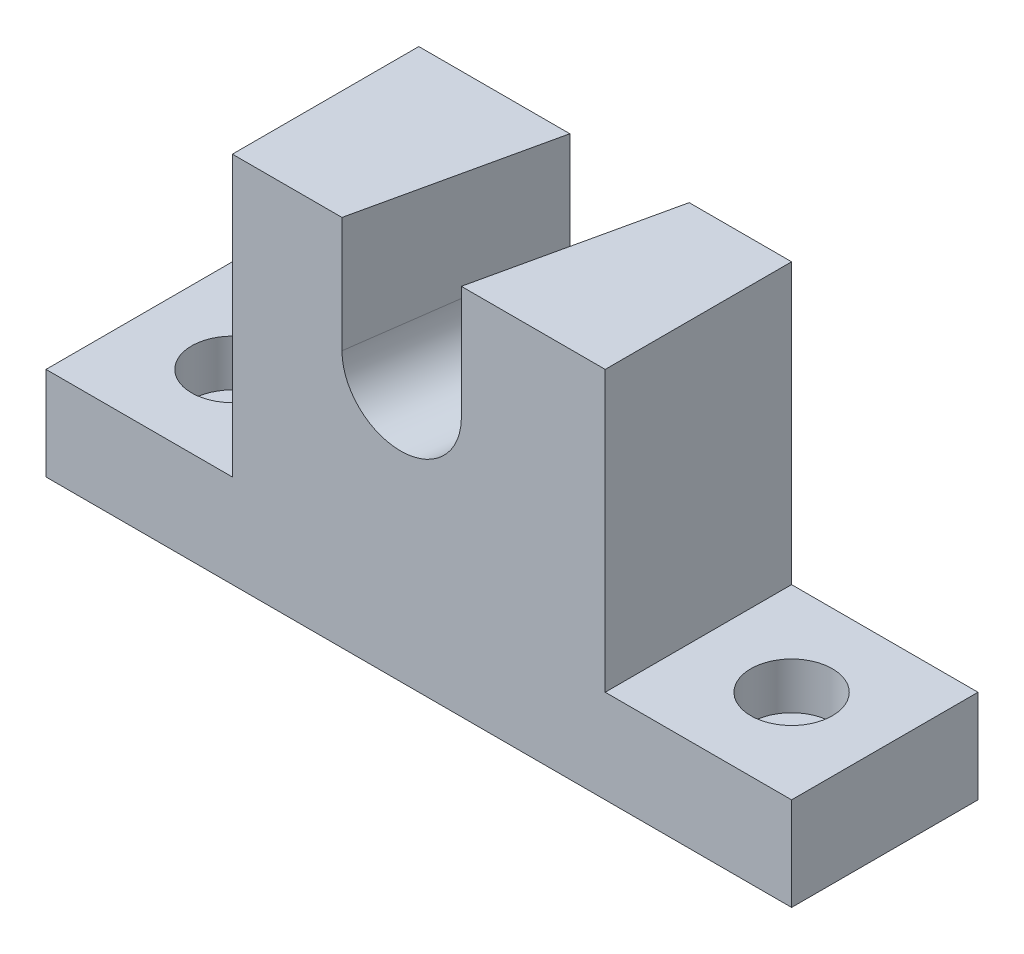
ISO-10303-21;
HEADER;
FILE_DESCRIPTION(('STEP AP214'),'2;1');
FILE_NAME('part.step','',(''),(''),'','','');
FILE_SCHEMA(('AUTOMOTIVE_DESIGN { 1 0 10303 214 1 1 1 1 }'));
ENDSEC;
DATA;
#1=APPLICATION_CONTEXT('core data for automotive mechanical design processes');
#2=APPLICATION_PROTOCOL_DEFINITION('international standard','automotive_design',2000,#1);
#3=PRODUCT_CONTEXT('',#1,'mechanical');
#4=PRODUCT('Part','Part','',(#3));
#5=PRODUCT_RELATED_PRODUCT_CATEGORY('part','',(#4));
#6=PRODUCT_DEFINITION_FORMATION('','',#4);
#7=PRODUCT_DEFINITION_CONTEXT('part definition',#1,'design');
#8=PRODUCT_DEFINITION('design','',#6,#7);
#9=PRODUCT_DEFINITION_SHAPE('','',#8);
#10=(LENGTH_UNIT() NAMED_UNIT(*) SI_UNIT(.MILLI.,.METRE.));
#11=(NAMED_UNIT(*) PLANE_ANGLE_UNIT() SI_UNIT($,.RADIAN.));
#12=(NAMED_UNIT(*) SI_UNIT($,.STERADIAN.) SOLID_ANGLE_UNIT());
#13=UNCERTAINTY_MEASURE_WITH_UNIT(LENGTH_MEASURE(1.E-05),#10,'distance_accuracy_value','');
#14=(GEOMETRIC_REPRESENTATION_CONTEXT(3) GLOBAL_UNCERTAINTY_ASSIGNED_CONTEXT((#13)) GLOBAL_UNIT_ASSIGNED_CONTEXT((#10,
#11,#12)) REPRESENTATION_CONTEXT('',''));
#15=CARTESIAN_POINT('',(0.,0.,0.));
#16=DIRECTION('',(0.,0.,1.));
#17=DIRECTION('',(1.,0.,0.));
#18=AXIS2_PLACEMENT_3D('',#15,#16,#17);
#19=CARTESIAN_POINT('',(-25.4,50.8,25.4));
#20=DIRECTION('',(0.,-1.,0.));
#21=DIRECTION('',(1.,0.,0.));
#22=AXIS2_PLACEMENT_3D('',#19,#20,#21);
#23=PLANE('',#22);
#24=DIRECTION('',(-0.217081662800933,0.,0.976153446787738));
#25=VECTOR('',#24,1.);
#26=CARTESIAN_POINT('',(-11.1715289843318,50.8,28.564195298762));
#27=LINE('',#26,#25);
#28=CARTESIAN_POINT('',(-4.81928689326416,50.8,0.));
#29=VERTEX_POINT('',#28);
#30=CARTESIAN_POINT('',(-10.4678601306874,50.8,25.4));
#31=VERTEX_POINT('',#30);
#32=EDGE_CURVE('E298',#29,#31,#27,.T.);
#33=ORIENTED_EDGE('',*,*,#32,.F.);
#34=DIRECTION('',(-1.,0.,0.));
#35=VECTOR('',#34,1.);
#36=CARTESIAN_POINT('',(-25.4,50.8,0.));
#37=LINE('',#36,#35);
#38=CARTESIAN_POINT('',(-25.4,50.8,0.));
#39=VERTEX_POINT('',#38);
#40=EDGE_CURVE('E131',#29,#39,#37,.T.);
#41=ORIENTED_EDGE('',*,*,#40,.T.);
#42=DIRECTION('',(0.,0.,-1.));
#43=VECTOR('',#42,1.);
#44=CARTESIAN_POINT('',(-25.4,50.8,25.4));
#45=LINE('',#44,#43);
#46=CARTESIAN_POINT('',(-25.4,50.8,25.4));
#47=VERTEX_POINT('',#46);
#48=EDGE_CURVE('E129',#47,#39,#45,.T.);
#49=ORIENTED_EDGE('',*,*,#48,.F.);
#50=DIRECTION('',(-1.,0.,0.));
#51=VECTOR('',#50,1.);
#52=CARTESIAN_POINT('',(-25.4,50.8,25.4));
#53=LINE('',#52,#51);
#54=EDGE_CURVE('E114',#31,#47,#53,.T.);
#55=ORIENTED_EDGE('',*,*,#54,.F.);
#56=EDGE_LOOP('',(#33,#41,#49,#55));
#57=FACE_BOUND('',#56,.T.);
#58=ADVANCED_FACE('F32',(#57),#23,.F.);
#59=CARTESIAN_POINT('',(0.,0.,25.4));
#60=DIRECTION('',(0.,0.,1.));
#61=DIRECTION('',(1.,0.,0.));
#62=AXIS2_PLACEMENT_3D('',#59,#60,#61);
#63=PLANE('',#62);
#64=CARTESIAN_POINT('',(-2.33645412467455,35.1902239310147,25.4));
#65=DIRECTION('',(0.,0.,1.));
#66=DIRECTION('',(-0.947845164465853,-0.318731147205134,0.));
#67=AXIS2_PLACEMENT_3D('',#64,#65,#66);
#68=ELLIPSE('',#67,8.15304209411346,7.9375);
#69=CARTESIAN_POINT('',(5.79495188133834,35.3190782655296,25.4));
#70=VERTEX_POINT('',#69);
#71=CARTESIAN_POINT('',(-10.4678601306874,35.0613695964998,25.4));
#72=VERTEX_POINT('',#71);
#73=EDGE_CURVE('E297',#70,#72,#68,.F.);
#74=ORIENTED_EDGE('',*,*,#73,.T.);
#75=DIRECTION('',(0.,1.,0.));
#76=VECTOR('',#75,1.);
#77=CARTESIAN_POINT('',(-10.4678601306874,0.,25.4));
#78=LINE('',#77,#76);
#79=EDGE_CURVE('E122',#72,#31,#78,.T.);
#80=ORIENTED_EDGE('',*,*,#79,.T.);
#81=ORIENTED_EDGE('',*,*,#54,.T.);
#82=DIRECTION('',(0.,-1.,0.));
#83=VECTOR('',#82,1.);
#84=CARTESIAN_POINT('',(-25.4,50.8,25.4));
#85=LINE('',#84,#83);
#86=CARTESIAN_POINT('',(-25.4,12.7,25.4));
#87=VERTEX_POINT('',#86);
#88=EDGE_CURVE('E119',#47,#87,#85,.T.);
#89=ORIENTED_EDGE('',*,*,#88,.T.);
#90=DIRECTION('',(-1.,0.,0.));
#91=VECTOR('',#90,1.);
#92=CARTESIAN_POINT('',(-50.8,12.7,25.4));
#93=LINE('',#92,#91);
#94=CARTESIAN_POINT('',(-50.8,12.7,25.4));
#95=VERTEX_POINT('',#94);
#96=EDGE_CURVE('E56',#87,#95,#93,.T.);
#97=ORIENTED_EDGE('',*,*,#96,.T.);
#98=DIRECTION('',(0.,-1.,0.));
#99=VECTOR('',#98,1.);
#100=CARTESIAN_POINT('',(-50.8,12.7,25.4));
#101=LINE('',#100,#99);
#102=CARTESIAN_POINT('',(-50.8,0.,25.4));
#103=VERTEX_POINT('',#102);
#104=EDGE_CURVE('E162',#95,#103,#101,.T.);
#105=ORIENTED_EDGE('',*,*,#104,.T.);
#106=DIRECTION('',(1.,0.,0.));
#107=VECTOR('',#106,1.);
#108=CARTESIAN_POINT('',(-50.8,0.,25.4));
#109=LINE('',#108,#107);
#110=CARTESIAN_POINT('',(50.8,0.,25.4));
#111=VERTEX_POINT('',#110);
#112=EDGE_CURVE('E98',#103,#111,#109,.T.);
#113=ORIENTED_EDGE('',*,*,#112,.T.);
#114=DIRECTION('',(0.,1.,0.));
#115=VECTOR('',#114,1.);
#116=CARTESIAN_POINT('',(50.8,12.7,25.4));
#117=LINE('',#116,#115);
#118=CARTESIAN_POINT('',(50.8,12.7,25.4));
#119=VERTEX_POINT('',#118);
#120=EDGE_CURVE('E230',#111,#119,#117,.T.);
#121=ORIENTED_EDGE('',*,*,#120,.T.);
#122=DIRECTION('',(-1.,0.,0.));
#123=VECTOR('',#122,1.);
#124=CARTESIAN_POINT('',(25.4,12.7,25.4));
#125=LINE('',#124,#123);
#126=CARTESIAN_POINT('',(25.4,12.7,25.4));
#127=VERTEX_POINT('',#126);
#128=EDGE_CURVE('E226',#119,#127,#125,.T.);
#129=ORIENTED_EDGE('',*,*,#128,.T.);
#130=DIRECTION('',(0.,1.,0.));
#131=VECTOR('',#130,1.);
#132=CARTESIAN_POINT('',(25.4,50.8,25.4));
#133=LINE('',#132,#131);
#134=CARTESIAN_POINT('',(25.4,50.8,25.4));
#135=VERTEX_POINT('',#134);
#136=EDGE_CURVE('E126',#127,#135,#133,.T.);
#137=ORIENTED_EDGE('',*,*,#136,.T.);
#138=CARTESIAN_POINT('',(5.79495188133833,50.8,25.4));
#139=VERTEX_POINT('',#138);
#140=EDGE_CURVE('E125',#135,#139,#53,.T.);
#141=ORIENTED_EDGE('',*,*,#140,.T.);
#142=DIRECTION('',(0.,1.,0.));
#143=VECTOR('',#142,1.);
#144=CARTESIAN_POINT('',(5.79495188133835,0.,25.4));
#145=LINE('',#144,#143);
#146=EDGE_CURVE('E296',#70,#139,#145,.T.);
#147=ORIENTED_EDGE('',*,*,#146,.F.);
#148=EDGE_LOOP('',(#74,#80,#81,#89,#97,#105,#113,#121,#129,#137,#141,#147));
#149=FACE_BOUND('',#148,.T.);
#150=ADVANCED_FACE('F117',(#149),#63,.T.);
#151=CARTESIAN_POINT('',(0.,0.,0.));
#152=DIRECTION('',(0.,0.,1.));
#153=DIRECTION('',(1.,0.,0.));
#154=AXIS2_PLACEMENT_3D('',#151,#152,#153);
#155=PLANE('',#154);
#156=DIRECTION('',(0.,1.,0.));
#157=VECTOR('',#156,1.);
#158=CARTESIAN_POINT('',(-4.81928689326416,0.,0.));
#159=LINE('',#158,#157);
#160=CARTESIAN_POINT('',(-4.81928689326416,36.9608108718591,0.));
#161=VERTEX_POINT('',#160);
#162=EDGE_CURVE('E11',#161,#29,#159,.T.);
#163=ORIENTED_EDGE('',*,*,#162,.F.);
#164=CARTESIAN_POINT('',(3.31211911274873,37.089665206374,0.));
#165=DIRECTION('',(0.,0.,1.));
#166=DIRECTION('',(-0.947845164465853,-0.318731147205134,0.));
#167=AXIS2_PLACEMENT_3D('',#164,#165,#166);
#168=ELLIPSE('',#167,8.15304209411346,7.9375);
#169=CARTESIAN_POINT('',(11.4435251187616,37.2185195408889,0.));
#170=VERTEX_POINT('',#169);
#171=EDGE_CURVE('E40',#170,#161,#168,.F.);
#172=ORIENTED_EDGE('',*,*,#171,.F.);
#173=DIRECTION('',(0.,1.,0.));
#174=VECTOR('',#173,1.);
#175=CARTESIAN_POINT('',(11.4435251187616,0.,0.));
#176=LINE('',#175,#174);
#177=CARTESIAN_POINT('',(11.4435251187616,50.8,0.));
#178=VERTEX_POINT('',#177);
#179=EDGE_CURVE('E178',#170,#178,#176,.T.);
#180=ORIENTED_EDGE('',*,*,#179,.T.);
#181=CARTESIAN_POINT('',(25.4,50.8,0.));
#182=VERTEX_POINT('',#181);
#183=EDGE_CURVE('E156',#182,#178,#37,.T.);
#184=ORIENTED_EDGE('',*,*,#183,.F.);
#185=DIRECTION('',(0.,1.,0.));
#186=VECTOR('',#185,1.);
#187=CARTESIAN_POINT('',(25.4,50.8,0.));
#188=LINE('',#187,#186);
#189=CARTESIAN_POINT('',(25.4,12.7,0.));
#190=VERTEX_POINT('',#189);
#191=EDGE_CURVE('E154',#190,#182,#188,.T.);
#192=ORIENTED_EDGE('',*,*,#191,.F.);
#193=DIRECTION('',(-1.,0.,0.));
#194=VECTOR('',#193,1.);
#195=CARTESIAN_POINT('',(25.4,12.7,0.));
#196=LINE('',#195,#194);
#197=CARTESIAN_POINT('',(50.8,12.7,0.));
#198=VERTEX_POINT('',#197);
#199=EDGE_CURVE('E152',#198,#190,#196,.T.);
#200=ORIENTED_EDGE('',*,*,#199,.F.);
#201=DIRECTION('',(0.,1.,0.));
#202=VECTOR('',#201,1.);
#203=CARTESIAN_POINT('',(50.8,12.7,0.));
#204=LINE('',#203,#202);
#205=CARTESIAN_POINT('',(50.8,0.,0.));
#206=VERTEX_POINT('',#205);
#207=EDGE_CURVE('E150',#206,#198,#204,.T.);
#208=ORIENTED_EDGE('',*,*,#207,.F.);
#209=DIRECTION('',(1.,0.,0.));
#210=VECTOR('',#209,1.);
#211=CARTESIAN_POINT('',(-50.8,0.,0.));
#212=LINE('',#211,#210);
#213=CARTESIAN_POINT('',(-50.8,0.,0.));
#214=VERTEX_POINT('',#213);
#215=EDGE_CURVE('E147',#214,#206,#212,.T.);
#216=ORIENTED_EDGE('',*,*,#215,.F.);
#217=DIRECTION('',(0.,-1.,0.));
#218=VECTOR('',#217,1.);
#219=CARTESIAN_POINT('',(-50.8,12.7,0.));
#220=LINE('',#219,#218);
#221=CARTESIAN_POINT('',(-50.8,12.7,0.));
#222=VERTEX_POINT('',#221);
#223=EDGE_CURVE('E144',#222,#214,#220,.T.);
#224=ORIENTED_EDGE('',*,*,#223,.F.);
#225=DIRECTION('',(-1.,0.,0.));
#226=VECTOR('',#225,1.);
#227=CARTESIAN_POINT('',(-50.8,12.7,0.));
#228=LINE('',#227,#226);
#229=CARTESIAN_POINT('',(-25.4,12.7,0.));
#230=VERTEX_POINT('',#229);
#231=EDGE_CURVE('E89',#230,#222,#228,.T.);
#232=ORIENTED_EDGE('',*,*,#231,.F.);
#233=DIRECTION('',(0.,-1.,0.));
#234=VECTOR('',#233,1.);
#235=CARTESIAN_POINT('',(-25.4,50.8,0.));
#236=LINE('',#235,#234);
#237=EDGE_CURVE('E159',#39,#230,#236,.T.);
#238=ORIENTED_EDGE('',*,*,#237,.F.);
#239=ORIENTED_EDGE('',*,*,#40,.F.);
#240=EDGE_LOOP('',(#163,#172,#180,#184,#192,#200,#208,#216,#224,#232,#238,#239));
#241=FACE_BOUND('',#240,.T.);
#242=ADVANCED_FACE('F202',(#241),#155,.F.);
#243=CARTESIAN_POINT('',(-50.8,12.7,25.4));
#244=DIRECTION('',(1.,0.,0.));
#245=DIRECTION('',(0.,1.,0.));
#246=AXIS2_PLACEMENT_3D('',#243,#244,#245);
#247=PLANE('',#246);
#248=ORIENTED_EDGE('',*,*,#223,.T.);
#249=DIRECTION('',(0.,0.,-1.));
#250=VECTOR('',#249,1.);
#251=CARTESIAN_POINT('',(-50.8,0.,25.4));
#252=LINE('',#251,#250);
#253=EDGE_CURVE('E176',#103,#214,#252,.T.);
#254=ORIENTED_EDGE('',*,*,#253,.F.);
#255=ORIENTED_EDGE('',*,*,#104,.F.);
#256=DIRECTION('',(0.,0.,-1.));
#257=VECTOR('',#256,1.);
#258=CARTESIAN_POINT('',(-50.8,12.7,25.4));
#259=LINE('',#258,#257);
#260=EDGE_CURVE('E139',#95,#222,#259,.T.);
#261=ORIENTED_EDGE('',*,*,#260,.T.);
#262=EDGE_LOOP('',(#248,#254,#255,#261));
#263=FACE_BOUND('',#262,.T.);
#264=ADVANCED_FACE('F34',(#263),#247,.F.);
#265=CARTESIAN_POINT('',(-50.8,0.,25.4));
#266=DIRECTION('',(0.,1.,0.));
#267=DIRECTION('',(-1.,0.,0.));
#268=AXIS2_PLACEMENT_3D('',#265,#266,#267);
#269=PLANE('',#268);
#270=CARTESIAN_POINT('',(-38.1,0.,12.7));
#271=DIRECTION('',(0.,1.,0.));
#272=DIRECTION('',(0.,0.,1.));
#273=AXIS2_PLACEMENT_3D('',#270,#271,#272);
#274=CIRCLE('',#273,3.3782);
#275=CARTESIAN_POINT('',(-38.1,0.,16.0782));
#276=VERTEX_POINT('',#275);
#277=EDGE_CURVE('E283',#276,#276,#274,.T.);
#278=ORIENTED_EDGE('',*,*,#277,.T.);
#279=EDGE_LOOP('',(#278));
#280=FACE_BOUND('',#279,.T.);
#281=CARTESIAN_POINT('',(38.1,0.,12.7));
#282=DIRECTION('',(0.,1.,0.));
#283=DIRECTION('',(0.,0.,1.));
#284=AXIS2_PLACEMENT_3D('',#281,#282,#283);
#285=CIRCLE('',#284,3.3782);
#286=CARTESIAN_POINT('',(38.1,0.,16.0782));
#287=VERTEX_POINT('',#286);
#288=EDGE_CURVE('E148',#287,#287,#285,.T.);
#289=ORIENTED_EDGE('',*,*,#288,.T.);
#290=EDGE_LOOP('',(#289));
#291=FACE_BOUND('',#290,.T.);
#292=ORIENTED_EDGE('',*,*,#215,.T.);
#293=DIRECTION('',(0.,0.,-1.));
#294=VECTOR('',#293,1.);
#295=CARTESIAN_POINT('',(50.8,0.,25.4));
#296=LINE('',#295,#294);
#297=EDGE_CURVE('E173',#111,#206,#296,.T.);
#298=ORIENTED_EDGE('',*,*,#297,.F.);
#299=ORIENTED_EDGE('',*,*,#112,.F.);
#300=ORIENTED_EDGE('',*,*,#253,.T.);
#301=EDGE_LOOP('',(#292,#298,#299,#300));
#302=FACE_BOUND('',#301,.T.);
#303=ADVANCED_FACE('F231',(#280,#291,#302),#269,.F.);
#304=CARTESIAN_POINT('',(50.8,12.7,25.4));
#305=DIRECTION('',(-1.,0.,0.));
#306=DIRECTION('',(0.,-1.,0.));
#307=AXIS2_PLACEMENT_3D('',#304,#305,#306);
#308=PLANE('',#307);
#309=ORIENTED_EDGE('',*,*,#207,.T.);
#310=DIRECTION('',(0.,0.,-1.));
#311=VECTOR('',#310,1.);
#312=CARTESIAN_POINT('',(50.8,12.7,25.4));
#313=LINE('',#312,#311);
#314=EDGE_CURVE('E170',#119,#198,#313,.T.);
#315=ORIENTED_EDGE('',*,*,#314,.F.);
#316=ORIENTED_EDGE('',*,*,#120,.F.);
#317=ORIENTED_EDGE('',*,*,#297,.T.);
#318=EDGE_LOOP('',(#309,#315,#316,#317));
#319=FACE_BOUND('',#318,.T.);
#320=ADVANCED_FACE('F229',(#319),#308,.F.);
#321=CARTESIAN_POINT('',(25.4,12.7,25.4));
#322=DIRECTION('',(0.,-1.,0.));
#323=DIRECTION('',(0.,0.,-1.));
#324=AXIS2_PLACEMENT_3D('',#321,#322,#323);
#325=PLANE('',#324);
#326=CARTESIAN_POINT('',(38.1,12.7,12.7));
#327=DIRECTION('',(0.,1.,0.));
#328=DIRECTION('',(0.,0.,1.));
#329=AXIS2_PLACEMENT_3D('',#326,#327,#328);
#330=CIRCLE('',#329,5.55625);
#331=CARTESIAN_POINT('',(38.1,12.7,18.25625));
#332=VERTEX_POINT('',#331);
#333=EDGE_CURVE('E315',#332,#332,#330,.T.);
#334=ORIENTED_EDGE('',*,*,#333,.F.);
#335=EDGE_LOOP('',(#334));
#336=FACE_BOUND('',#335,.T.);
#337=ORIENTED_EDGE('',*,*,#199,.T.);
#338=DIRECTION('',(0.,0.,-1.));
#339=VECTOR('',#338,1.);
#340=CARTESIAN_POINT('',(25.4,12.7,25.4));
#341=LINE('',#340,#339);
#342=EDGE_CURVE('E167',#127,#190,#341,.T.);
#343=ORIENTED_EDGE('',*,*,#342,.F.);
#344=ORIENTED_EDGE('',*,*,#128,.F.);
#345=ORIENTED_EDGE('',*,*,#314,.T.);
#346=EDGE_LOOP('',(#337,#343,#344,#345));
#347=FACE_BOUND('',#346,.T.);
#348=ADVANCED_FACE('F223',(#336,#347),#325,.F.);
#349=CARTESIAN_POINT('',(25.4,50.8,25.4));
#350=DIRECTION('',(-1.,0.,0.));
#351=DIRECTION('',(0.,-1.,0.));
#352=AXIS2_PLACEMENT_3D('',#349,#350,#351);
#353=PLANE('',#352);
#354=ORIENTED_EDGE('',*,*,#191,.T.);
#355=DIRECTION('',(0.,0.,-1.));
#356=VECTOR('',#355,1.);
#357=CARTESIAN_POINT('',(25.4,50.8,25.4));
#358=LINE('',#357,#356);
#359=EDGE_CURVE('E134',#135,#182,#358,.T.);
#360=ORIENTED_EDGE('',*,*,#359,.F.);
#361=ORIENTED_EDGE('',*,*,#136,.F.);
#362=ORIENTED_EDGE('',*,*,#342,.T.);
#363=EDGE_LOOP('',(#354,#360,#361,#362));
#364=FACE_BOUND('',#363,.T.);
#365=ADVANCED_FACE('F218',(#364),#353,.F.);
#366=ORIENTED_EDGE('',*,*,#183,.T.);
#367=DIRECTION('',(-0.217081662800933,0.,0.976153446787738));
#368=VECTOR('',#367,1.);
#369=CARTESIAN_POINT('',(4.32490698342349,50.8,32.0103666957269));
#370=LINE('',#369,#368);
#371=EDGE_CURVE('E47',#178,#139,#370,.T.);
#372=ORIENTED_EDGE('',*,*,#371,.T.);
#373=ORIENTED_EDGE('',*,*,#140,.F.);
#374=ORIENTED_EDGE('',*,*,#359,.T.);
#375=EDGE_LOOP('',(#366,#372,#373,#374));
#376=FACE_BOUND('',#375,.T.);
#377=ADVANCED_FACE('F213',(#376),#23,.F.);
#378=CARTESIAN_POINT('',(-25.4,50.8,25.4));
#379=DIRECTION('',(1.,0.,0.));
#380=DIRECTION('',(0.,1.,0.));
#381=AXIS2_PLACEMENT_3D('',#378,#379,#380);
#382=PLANE('',#381);
#383=ORIENTED_EDGE('',*,*,#237,.T.);
#384=DIRECTION('',(0.,0.,-1.));
#385=VECTOR('',#384,1.);
#386=CARTESIAN_POINT('',(-25.4,12.7,25.4));
#387=LINE('',#386,#385);
#388=EDGE_CURVE('E135',#87,#230,#387,.T.);
#389=ORIENTED_EDGE('',*,*,#388,.F.);
#390=ORIENTED_EDGE('',*,*,#88,.F.);
#391=ORIENTED_EDGE('',*,*,#48,.T.);
#392=EDGE_LOOP('',(#383,#389,#390,#391));
#393=FACE_BOUND('',#392,.T.);
#394=ADVANCED_FACE('F137',(#393),#382,.F.);
#395=CARTESIAN_POINT('',(-50.8,12.7,25.4));
#396=DIRECTION('',(0.,-1.,0.));
#397=DIRECTION('',(1.,0.,0.));
#398=AXIS2_PLACEMENT_3D('',#395,#396,#397);
#399=PLANE('',#398);
#400=CARTESIAN_POINT('',(-38.1,12.7,12.7));
#401=DIRECTION('',(0.,1.,0.));
#402=DIRECTION('',(0.,0.,1.));
#403=AXIS2_PLACEMENT_3D('',#400,#401,#402);
#404=CIRCLE('',#403,5.55625);
#405=CARTESIAN_POINT('',(-38.1,12.7,18.25625));
#406=VERTEX_POINT('',#405);
#407=EDGE_CURVE('E305',#406,#406,#404,.T.);
#408=ORIENTED_EDGE('',*,*,#407,.F.);
#409=EDGE_LOOP('',(#408));
#410=FACE_BOUND('',#409,.T.);
#411=ORIENTED_EDGE('',*,*,#231,.T.);
#412=ORIENTED_EDGE('',*,*,#260,.F.);
#413=ORIENTED_EDGE('',*,*,#96,.F.);
#414=ORIENTED_EDGE('',*,*,#388,.T.);
#415=EDGE_LOOP('',(#411,#412,#413,#414));
#416=FACE_BOUND('',#415,.T.);
#417=ADVANCED_FACE('F236',(#410,#416),#399,.F.);
#418=CARTESIAN_POINT('',(38.1,12.7,12.7));
#419=DIRECTION('',(0.,1.,0.));
#420=DIRECTION('',(0.,0.,1.));
#421=AXIS2_PLACEMENT_3D('',#418,#419,#420);
#422=CYLINDRICAL_SURFACE('',#421,3.3782);
#423=ORIENTED_EDGE('',*,*,#288,.F.);
#424=EDGE_LOOP('',(#423));
#425=FACE_BOUND('',#424,.T.);
#426=CARTESIAN_POINT('',(38.1,6.35000000000002,12.7));
#427=DIRECTION('',(0.,1.,0.));
#428=DIRECTION('',(0.,0.,1.));
#429=AXIS2_PLACEMENT_3D('',#426,#427,#428);
#430=CIRCLE('',#429,3.3782);
#431=CARTESIAN_POINT('',(38.1,6.35000000000002,16.0782));
#432=VERTEX_POINT('',#431);
#433=EDGE_CURVE('E286',#432,#432,#430,.T.);
#434=ORIENTED_EDGE('',*,*,#433,.T.);
#435=EDGE_LOOP('',(#434));
#436=FACE_BOUND('',#435,.T.);
#437=ADVANCED_FACE('F238',(#425,#436),#422,.F.);
#438=CARTESIAN_POINT('',(41.4782,6.35000000000002,12.7));
#439=DIRECTION('',(0.,-1.,0.));
#440=DIRECTION('',(0.,0.,-1.));
#441=AXIS2_PLACEMENT_3D('',#438,#439,#440);
#442=PLANE('',#441);
#443=ORIENTED_EDGE('',*,*,#433,.F.);
#444=EDGE_LOOP('',(#443));
#445=FACE_BOUND('',#444,.T.);
#446=CARTESIAN_POINT('',(38.1,6.35000000000002,12.7));
#447=DIRECTION('',(0.,1.,0.));
#448=DIRECTION('',(0.,0.,1.));
#449=AXIS2_PLACEMENT_3D('',#446,#447,#448);
#450=CIRCLE('',#449,5.55625);
#451=CARTESIAN_POINT('',(38.1,6.35000000000002,18.25625));
#452=VERTEX_POINT('',#451);
#453=EDGE_CURVE('E289',#452,#452,#450,.T.);
#454=ORIENTED_EDGE('',*,*,#453,.T.);
#455=EDGE_LOOP('',(#454));
#456=FACE_BOUND('',#455,.T.);
#457=ADVANCED_FACE('F246',(#445,#456),#442,.F.);
#458=CARTESIAN_POINT('',(38.1,12.7,12.7));
#459=DIRECTION('',(0.,1.,0.));
#460=DIRECTION('',(0.,0.,1.));
#461=AXIS2_PLACEMENT_3D('',#458,#459,#460);
#462=CYLINDRICAL_SURFACE('',#461,5.55625);
#463=ORIENTED_EDGE('',*,*,#453,.F.);
#464=EDGE_LOOP('',(#463));
#465=FACE_BOUND('',#464,.T.);
#466=ORIENTED_EDGE('',*,*,#333,.T.);
#467=EDGE_LOOP('',(#466));
#468=FACE_BOUND('',#467,.T.);
#469=ADVANCED_FACE('F321',(#465,#468),#462,.F.);
#470=CARTESIAN_POINT('',(-38.1,12.7,12.7));
#471=DIRECTION('',(0.,1.,0.));
#472=DIRECTION('',(0.,0.,1.));
#473=AXIS2_PLACEMENT_3D('',#470,#471,#472);
#474=CYLINDRICAL_SURFACE('',#473,3.3782);
#475=ORIENTED_EDGE('',*,*,#277,.F.);
#476=EDGE_LOOP('',(#475));
#477=FACE_BOUND('',#476,.T.);
#478=CARTESIAN_POINT('',(-38.1,6.35,12.7));
#479=DIRECTION('',(0.,1.,0.));
#480=DIRECTION('',(0.,0.,1.));
#481=AXIS2_PLACEMENT_3D('',#478,#479,#480);
#482=CIRCLE('',#481,3.3782);
#483=CARTESIAN_POINT('',(-38.1,6.35,16.0782));
#484=VERTEX_POINT('',#483);
#485=EDGE_CURVE('E311',#484,#484,#482,.T.);
#486=ORIENTED_EDGE('',*,*,#485,.T.);
#487=EDGE_LOOP('',(#486));
#488=FACE_BOUND('',#487,.T.);
#489=ADVANCED_FACE('F324',(#477,#488),#474,.F.);
#490=CARTESIAN_POINT('',(-34.7218,6.35,12.7));
#491=DIRECTION('',(0.,-1.,0.));
#492=DIRECTION('',(0.,0.,-1.));
#493=AXIS2_PLACEMENT_3D('',#490,#491,#492);
#494=PLANE('',#493);
#495=ORIENTED_EDGE('',*,*,#485,.F.);
#496=EDGE_LOOP('',(#495));
#497=FACE_BOUND('',#496,.T.);
#498=CARTESIAN_POINT('',(-38.1,6.35,12.7));
#499=DIRECTION('',(0.,1.,0.));
#500=DIRECTION('',(0.,0.,1.));
#501=AXIS2_PLACEMENT_3D('',#498,#499,#500);
#502=CIRCLE('',#501,5.55625);
#503=CARTESIAN_POINT('',(-38.1,6.35,18.25625));
#504=VERTEX_POINT('',#503);
#505=EDGE_CURVE('E308',#504,#504,#502,.T.);
#506=ORIENTED_EDGE('',*,*,#505,.T.);
#507=EDGE_LOOP('',(#506));
#508=FACE_BOUND('',#507,.T.);
#509=ADVANCED_FACE('F331',(#497,#508),#494,.F.);
#510=CARTESIAN_POINT('',(-38.1,12.7,12.7));
#511=DIRECTION('',(0.,1.,0.));
#512=DIRECTION('',(0.,0.,1.));
#513=AXIS2_PLACEMENT_3D('',#510,#511,#512);
#514=CYLINDRICAL_SURFACE('',#513,5.55625);
#515=ORIENTED_EDGE('',*,*,#505,.F.);
#516=EDGE_LOOP('',(#515));
#517=FACE_BOUND('',#516,.T.);
#518=ORIENTED_EDGE('',*,*,#407,.T.);
#519=EDGE_LOOP('',(#518));
#520=FACE_BOUND('',#519,.T.);
#521=ADVANCED_FACE('F358',(#517,#520),#514,.F.);
#522=CARTESIAN_POINT('',(5.75420700707648,37.9108641799147,-10.9813628873511));
#523=DIRECTION('',(-0.216505583599187,-0.0728041621394714,0.973562985248281));
#524=DIRECTION('',(0.976153446787738,0.,0.217081662800933));
#525=AXIS2_PLACEMENT_3D('',#522,#523,#524);
#526=CYLINDRICAL_SURFACE('',#525,7.9375);
#527=DIRECTION('',(-0.216505583599187,-0.0728041621394714,0.973562985248281));
#528=VECTOR('',#527,1.);
#529=CARTESIAN_POINT('',(13.5024249909542,37.9108641799147,-9.25827718886872));
#530=LINE('',#529,#528);
#531=EDGE_CURVE('E192',#170,#70,#530,.T.);
#532=ORIENTED_EDGE('',*,*,#531,.F.);
#533=ORIENTED_EDGE('',*,*,#171,.T.);
#534=DIRECTION('',(-0.216505583599187,-0.0728041621394714,0.973562985248281));
#535=VECTOR('',#534,1.);
#536=CARTESIAN_POINT('',(-1.99401097680119,37.9108641799147,-12.7044485858335));
#537=LINE('',#536,#535);
#538=EDGE_CURVE('E189',#161,#72,#537,.T.);
#539=ORIENTED_EDGE('',*,*,#538,.T.);
#540=ORIENTED_EDGE('',*,*,#73,.F.);
#541=EDGE_LOOP('',(#532,#533,#539,#540));
#542=FACE_BOUND('',#541,.T.);
#543=ADVANCED_FACE('F186',(#542),#526,.F.);
#544=CARTESIAN_POINT('',(-1.41021214972428,1.06999804477416,-15.3296230475031));
#545=DIRECTION('',(0.976153446787738,0.,0.217081662800933));
#546=DIRECTION('',(0.217081662800933,0.,-0.976153446787738));
#547=AXIS2_PLACEMENT_3D('',#544,#545,#546);
#548=PLANE('',#547);
#549=ORIENTED_EDGE('',*,*,#538,.F.);
#550=ORIENTED_EDGE('',*,*,#162,.T.);
#551=ORIENTED_EDGE('',*,*,#32,.T.);
#552=ORIENTED_EDGE('',*,*,#79,.F.);
#553=EDGE_LOOP('',(#549,#550,#551,#552));
#554=FACE_BOUND('',#553,.T.);
#555=ADVANCED_FACE('F198',(#554),#548,.T.);
#556=CARTESIAN_POINT('',(14.0862238180311,1.06999804477416,-11.8834516505382));
#557=DIRECTION('',(0.976153446787738,0.,0.217081662800933));
#558=DIRECTION('',(0.217081662800933,0.,-0.976153446787738));
#559=AXIS2_PLACEMENT_3D('',#556,#557,#558);
#560=PLANE('',#559);
#561=ORIENTED_EDGE('',*,*,#146,.T.);
#562=ORIENTED_EDGE('',*,*,#371,.F.);
#563=ORIENTED_EDGE('',*,*,#179,.F.);
#564=ORIENTED_EDGE('',*,*,#531,.T.);
#565=EDGE_LOOP('',(#561,#562,#563,#564));
#566=FACE_BOUND('',#565,.T.);
#567=ADVANCED_FACE('F208',(#566),#560,.F.);
#568=CLOSED_SHELL('',(#58,#150,#242,#264,#303,#320,#348,#365,#377,#394,#417,#437,#457,#469,#489,
#509,#521,#543,#555,#567));
#569=MANIFOLD_SOLID_BREP('B2',#568);
#570=ADVANCED_BREP_SHAPE_REPRESENTATION('',(#18,#569),#14);
#571=SHAPE_DEFINITION_REPRESENTATION(#9,#570);
ENDSEC;
END-ISO-10303-21;
